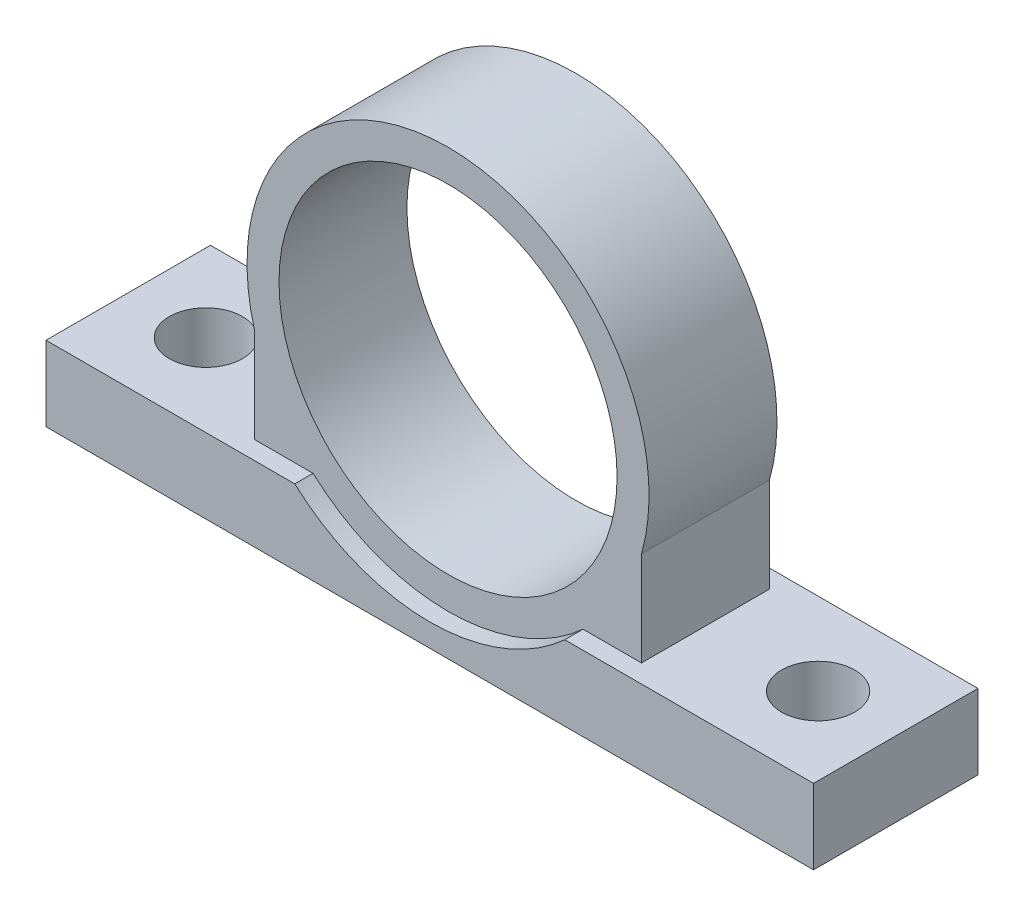
ISO-10303-21;
HEADER;
FILE_DESCRIPTION(('STEP AP214'),'2;1');
FILE_NAME('part.step','',(''),(''),'','','');
FILE_SCHEMA(('AUTOMOTIVE_DESIGN { 1 0 10303 214 1 1 1 1 }'));
ENDSEC;
DATA;
#1=APPLICATION_CONTEXT('core data for automotive mechanical design processes');
#2=APPLICATION_PROTOCOL_DEFINITION('international standard','automotive_design',2000,#1);
#3=PRODUCT_CONTEXT('',#1,'mechanical');
#4=PRODUCT('Part','Part','',(#3));
#5=PRODUCT_RELATED_PRODUCT_CATEGORY('part','',(#4));
#6=PRODUCT_DEFINITION_FORMATION('','',#4);
#7=PRODUCT_DEFINITION_CONTEXT('part definition',#1,'design');
#8=PRODUCT_DEFINITION('design','',#6,#7);
#9=PRODUCT_DEFINITION_SHAPE('','',#8);
#10=(LENGTH_UNIT() NAMED_UNIT(*) SI_UNIT(.MILLI.,.METRE.));
#11=(NAMED_UNIT(*) PLANE_ANGLE_UNIT() SI_UNIT($,.RADIAN.));
#12=(NAMED_UNIT(*) SI_UNIT($,.STERADIAN.) SOLID_ANGLE_UNIT());
#13=UNCERTAINTY_MEASURE_WITH_UNIT(LENGTH_MEASURE(1.E-05),#10,'distance_accuracy_value','');
#14=(GEOMETRIC_REPRESENTATION_CONTEXT(3) GLOBAL_UNCERTAINTY_ASSIGNED_CONTEXT((#13)) GLOBAL_UNIT_ASSIGNED_CONTEXT((#10,
#11,#12)) REPRESENTATION_CONTEXT('',''));
#15=CARTESIAN_POINT('',(0.,0.,0.));
#16=DIRECTION('',(0.,0.,1.));
#17=DIRECTION('',(1.,0.,0.));
#18=AXIS2_PLACEMENT_3D('',#15,#16,#17);
#19=CARTESIAN_POINT('',(-20.8246827445229,8.19999999999999,18.));
#20=DIRECTION('',(-1.,0.,0.));
#21=DIRECTION('',(0.,0.,1.));
#22=AXIS2_PLACEMENT_3D('',#19,#20,#21);
#23=PLANE('',#22);
#24=DIRECTION('',(0.,1.,0.));
#25=VECTOR('',#24,1.);
#26=CARTESIAN_POINT('',(-20.8246827445229,8.19999999999999,2.));
#27=LINE('',#26,#25);
#28=CARTESIAN_POINT('',(-20.8246827445229,8.19999999999999,2.));
#29=VERTEX_POINT('',#28);
#30=CARTESIAN_POINT('',(-20.8246827445229,18.5329287644697,2.));
#31=VERTEX_POINT('',#30);
#32=EDGE_CURVE('E151',#29,#31,#27,.T.);
#33=ORIENTED_EDGE('',*,*,#32,.T.);
#34=DIRECTION('',(0.,0.,-1.));
#35=VECTOR('',#34,1.);
#36=CARTESIAN_POINT('',(-20.8246827445229,18.5329287644697,18.));
#37=LINE('',#36,#35);
#38=CARTESIAN_POINT('',(-20.8246827445229,18.5329287644697,16.));
#39=VERTEX_POINT('',#38);
#40=EDGE_CURVE('E166',#39,#31,#37,.T.);
#41=ORIENTED_EDGE('',*,*,#40,.F.);
#42=DIRECTION('',(0.,1.,0.));
#43=VECTOR('',#42,1.);
#44=CARTESIAN_POINT('',(-20.8246827445229,8.19999999999999,16.));
#45=LINE('',#44,#43);
#46=CARTESIAN_POINT('',(-20.8246827445229,8.19999999999999,16.));
#47=VERTEX_POINT('',#46);
#48=EDGE_CURVE('E164',#47,#39,#45,.T.);
#49=ORIENTED_EDGE('',*,*,#48,.F.);
#50=DIRECTION('',(0.,0.,-1.));
#51=VECTOR('',#50,1.);
#52=CARTESIAN_POINT('',(-20.8246827445229,8.19999999999999,18.));
#53=LINE('',#52,#51);
#54=EDGE_CURVE('E49',#47,#29,#53,.T.);
#55=ORIENTED_EDGE('',*,*,#54,.T.);
#56=EDGE_LOOP('',(#33,#41,#49,#55));
#57=FACE_BOUND('',#56,.T.);
#58=ADVANCED_FACE('F39',(#57),#23,.F.);
#59=CARTESIAN_POINT('',(-42.,24.5,18.));
#60=DIRECTION('',(0.,0.,-1.));
#61=DIRECTION('',(-1.,0.,0.));
#62=AXIS2_PLACEMENT_3D('',#59,#60,#61);
#63=CYLINDRICAL_SURFACE('',#62,22.);
#64=CARTESIAN_POINT('',(-42.,24.5,2.));
#65=DIRECTION('',(0.,0.,1.));
#66=DIRECTION('',(1.,0.,0.));
#67=AXIS2_PLACEMENT_3D('',#64,#65,#66);
#68=CIRCLE('',#67,22.);
#69=CARTESIAN_POINT('',(-63.1753172554771,18.5329287644697,2.));
#70=VERTEX_POINT('',#69);
#71=EDGE_CURVE('E156',#31,#70,#68,.T.);
#72=ORIENTED_EDGE('',*,*,#71,.T.);
#73=DIRECTION('',(0.,0.,-1.));
#74=VECTOR('',#73,1.);
#75=CARTESIAN_POINT('',(-63.1753172554771,18.5329287644697,18.));
#76=LINE('',#75,#74);
#77=CARTESIAN_POINT('',(-63.1753172554771,18.5329287644697,16.));
#78=VERTEX_POINT('',#77);
#79=EDGE_CURVE('E169',#78,#70,#76,.T.);
#80=ORIENTED_EDGE('',*,*,#79,.F.);
#81=CARTESIAN_POINT('',(-42.,24.5,16.));
#82=DIRECTION('',(0.,0.,1.));
#83=DIRECTION('',(1.,0.,0.));
#84=AXIS2_PLACEMENT_3D('',#81,#82,#83);
#85=CIRCLE('',#84,22.);
#86=EDGE_CURVE('E241',#39,#78,#85,.T.);
#87=ORIENTED_EDGE('',*,*,#86,.F.);
#88=ORIENTED_EDGE('',*,*,#40,.T.);
#89=EDGE_LOOP('',(#72,#80,#87,#88));
#90=FACE_BOUND('',#89,.T.);
#91=ADVANCED_FACE('F316',(#90),#63,.T.);
#92=CARTESIAN_POINT('',(-63.1753172554771,8.19999999999999,18.));
#93=DIRECTION('',(1.,0.,0.));
#94=DIRECTION('',(0.,0.,-1.));
#95=AXIS2_PLACEMENT_3D('',#92,#93,#94);
#96=PLANE('',#95);
#97=DIRECTION('',(0.,-1.,0.));
#98=VECTOR('',#97,1.);
#99=CARTESIAN_POINT('',(-63.1753172554771,8.19999999999999,2.));
#100=LINE('',#99,#98);
#101=CARTESIAN_POINT('',(-63.1753172554771,8.19999999999999,2.));
#102=VERTEX_POINT('',#101);
#103=EDGE_CURVE('E261',#70,#102,#100,.T.);
#104=ORIENTED_EDGE('',*,*,#103,.T.);
#105=DIRECTION('',(0.,0.,-1.));
#106=VECTOR('',#105,1.);
#107=CARTESIAN_POINT('',(-63.1753172554771,8.19999999999999,18.));
#108=LINE('',#107,#106);
#109=CARTESIAN_POINT('',(-63.1753172554771,8.19999999999999,16.));
#110=VERTEX_POINT('',#109);
#111=EDGE_CURVE('E175',#110,#102,#108,.T.);
#112=ORIENTED_EDGE('',*,*,#111,.F.);
#113=DIRECTION('',(0.,-1.,0.));
#114=VECTOR('',#113,1.);
#115=CARTESIAN_POINT('',(-63.1753172554771,8.19999999999999,16.));
#116=LINE('',#115,#114);
#117=EDGE_CURVE('E56',#78,#110,#116,.T.);
#118=ORIENTED_EDGE('',*,*,#117,.F.);
#119=ORIENTED_EDGE('',*,*,#79,.T.);
#120=EDGE_LOOP('',(#104,#112,#118,#119));
#121=FACE_BOUND('',#120,.T.);
#122=ADVANCED_FACE('F320',(#121),#96,.F.);
#123=CARTESIAN_POINT('',(-42.,24.5,18.));
#124=DIRECTION('',(0.,0.,-1.));
#125=DIRECTION('',(-1.,0.,0.));
#126=AXIS2_PLACEMENT_3D('',#123,#124,#125);
#127=CYLINDRICAL_SURFACE('',#126,18.5);
#128=CARTESIAN_POINT('',(-42.,24.5,16.));
#129=DIRECTION('',(0.,0.,1.));
#130=DIRECTION('',(1.,0.,0.));
#131=AXIS2_PLACEMENT_3D('',#128,#129,#130);
#132=CIRCLE('',#131,18.5);
#133=CARTESIAN_POINT('',(-23.5,24.5,16.));
#134=VERTEX_POINT('',#133);
#135=EDGE_CURVE('E43',#134,#134,#132,.T.);
#136=ORIENTED_EDGE('',*,*,#135,.T.);
#137=EDGE_LOOP('',(#136));
#138=FACE_BOUND('',#137,.T.);
#139=CARTESIAN_POINT('',(-42.,24.5,2.00000000000001));
#140=DIRECTION('',(0.,0.,-1.));
#141=DIRECTION('',(-1.,0.,0.));
#142=AXIS2_PLACEMENT_3D('',#139,#140,#141);
#143=CIRCLE('',#142,18.5);
#144=CARTESIAN_POINT('',(-60.5,24.5,2.00000000000001));
#145=VERTEX_POINT('',#144);
#146=EDGE_CURVE('E229',#145,#145,#143,.T.);
#147=ORIENTED_EDGE('',*,*,#146,.T.);
#148=EDGE_LOOP('',(#147));
#149=FACE_BOUND('',#148,.T.);
#150=ADVANCED_FACE('F325',(#138,#149),#127,.F.);
#151=CARTESIAN_POINT('',(-42.,24.5,0.));
#152=DIRECTION('',(0.,0.,1.));
#153=DIRECTION('',(1.,0.,0.));
#154=AXIS2_PLACEMENT_3D('',#151,#152,#153);
#155=PLANE('',#154);
#156=DIRECTION('',(-1.,0.,0.));
#157=VECTOR('',#156,1.);
#158=CARTESIAN_POINT('',(-84.,8.19999999999999,0.));
#159=LINE('',#158,#157);
#160=CARTESIAN_POINT('',(-56.7753172554771,8.2,0.));
#161=VERTEX_POINT('',#160);
#162=CARTESIAN_POINT('',(-84.,8.19999999999999,0.));
#163=VERTEX_POINT('',#162);
#164=EDGE_CURVE('E195',#161,#163,#159,.T.);
#165=ORIENTED_EDGE('',*,*,#164,.F.);
#166=CARTESIAN_POINT('',(-42.,24.5,0.));
#167=DIRECTION('',(0.,0.,1.));
#168=DIRECTION('',(1.,0.,0.));
#169=AXIS2_PLACEMENT_3D('',#166,#167,#168);
#170=CIRCLE('',#169,22.);
#171=CARTESIAN_POINT('',(-27.2246827445229,8.19999999999999,0.));
#172=VERTEX_POINT('',#171);
#173=EDGE_CURVE('E161',#161,#172,#170,.T.);
#174=ORIENTED_EDGE('',*,*,#173,.T.);
#175=DIRECTION('',(-1.,0.,0.));
#176=VECTOR('',#175,1.);
#177=CARTESIAN_POINT('',(-20.8246827445229,8.19999999999999,0.));
#178=LINE('',#177,#176);
#179=CARTESIAN_POINT('',(0.,8.19999999999999,0.));
#180=VERTEX_POINT('',#179);
#181=EDGE_CURVE('E198',#180,#172,#178,.T.);
#182=ORIENTED_EDGE('',*,*,#181,.F.);
#183=DIRECTION('',(0.,1.,0.));
#184=VECTOR('',#183,1.);
#185=CARTESIAN_POINT('',(0.,8.19999999999999,0.));
#186=LINE('',#185,#184);
#187=CARTESIAN_POINT('',(0.,0.,0.));
#188=VERTEX_POINT('',#187);
#189=EDGE_CURVE('E201',#188,#180,#186,.T.);
#190=ORIENTED_EDGE('',*,*,#189,.F.);
#191=DIRECTION('',(1.,0.,0.));
#192=VECTOR('',#191,1.);
#193=CARTESIAN_POINT('',(0.,0.,0.));
#194=LINE('',#193,#192);
#195=CARTESIAN_POINT('',(-84.,0.,0.));
#196=VERTEX_POINT('',#195);
#197=EDGE_CURVE('E86',#196,#188,#194,.T.);
#198=ORIENTED_EDGE('',*,*,#197,.F.);
#199=DIRECTION('',(0.,-1.,0.));
#200=VECTOR('',#199,1.);
#201=CARTESIAN_POINT('',(-84.,0.,0.));
#202=LINE('',#201,#200);
#203=EDGE_CURVE('E192',#163,#196,#202,.T.);
#204=ORIENTED_EDGE('',*,*,#203,.F.);
#205=EDGE_LOOP('',(#165,#174,#182,#190,#198,#204));
#206=FACE_BOUND('',#205,.T.);
#207=ADVANCED_FACE('F331',(#206),#155,.F.);
#208=CARTESIAN_POINT('',(-42.,24.5,18.));
#209=DIRECTION('',(0.,0.,1.));
#210=DIRECTION('',(1.,0.,0.));
#211=AXIS2_PLACEMENT_3D('',#208,#209,#210);
#212=PLANE('',#211);
#213=DIRECTION('',(-1.,0.,0.));
#214=VECTOR('',#213,1.);
#215=CARTESIAN_POINT('',(-20.8246827445229,8.19999999999999,18.));
#216=LINE('',#215,#214);
#217=CARTESIAN_POINT('',(0.,8.19999999999999,18.));
#218=VERTEX_POINT('',#217);
#219=CARTESIAN_POINT('',(-27.2246827445229,8.19999999999999,18.));
#220=VERTEX_POINT('',#219);
#221=EDGE_CURVE('E93',#218,#220,#216,.T.);
#222=ORIENTED_EDGE('',*,*,#221,.T.);
#223=CARTESIAN_POINT('',(-42.,24.5,18.));
#224=DIRECTION('',(0.,0.,1.));
#225=DIRECTION('',(1.,0.,0.));
#226=AXIS2_PLACEMENT_3D('',#223,#224,#225);
#227=CIRCLE('',#226,22.);
#228=CARTESIAN_POINT('',(-56.7753172554771,8.2,18.));
#229=VERTEX_POINT('',#228);
#230=EDGE_CURVE('E225',#229,#220,#227,.T.);
#231=ORIENTED_EDGE('',*,*,#230,.F.);
#232=DIRECTION('',(-1.,0.,0.));
#233=VECTOR('',#232,1.);
#234=CARTESIAN_POINT('',(-84.,8.19999999999999,18.));
#235=LINE('',#234,#233);
#236=CARTESIAN_POINT('',(-84.,8.19999999999999,18.));
#237=VERTEX_POINT('',#236);
#238=EDGE_CURVE('E210',#229,#237,#235,.T.);
#239=ORIENTED_EDGE('',*,*,#238,.T.);
#240=DIRECTION('',(0.,-1.,0.));
#241=VECTOR('',#240,1.);
#242=CARTESIAN_POINT('',(-84.,0.,18.));
#243=LINE('',#242,#241);
#244=CARTESIAN_POINT('',(-84.,0.,18.));
#245=VERTEX_POINT('',#244);
#246=EDGE_CURVE('E207',#237,#245,#243,.T.);
#247=ORIENTED_EDGE('',*,*,#246,.T.);
#248=DIRECTION('',(1.,0.,0.));
#249=VECTOR('',#248,1.);
#250=CARTESIAN_POINT('',(0.,0.,18.));
#251=LINE('',#250,#249);
#252=CARTESIAN_POINT('',(0.,0.,18.));
#253=VERTEX_POINT('',#252);
#254=EDGE_CURVE('E65',#245,#253,#251,.T.);
#255=ORIENTED_EDGE('',*,*,#254,.T.);
#256=DIRECTION('',(0.,1.,0.));
#257=VECTOR('',#256,1.);
#258=CARTESIAN_POINT('',(0.,8.19999999999999,18.));
#259=LINE('',#258,#257);
#260=EDGE_CURVE('E191',#253,#218,#259,.T.);
#261=ORIENTED_EDGE('',*,*,#260,.T.);
#262=EDGE_LOOP('',(#222,#231,#239,#247,#255,#261));
#263=FACE_BOUND('',#262,.T.);
#264=ADVANCED_FACE('F312',(#263),#212,.T.);
#265=CARTESIAN_POINT('',(0.,8.19999999999999,18.));
#266=DIRECTION('',(-1.,0.,0.));
#267=DIRECTION('',(0.,0.,1.));
#268=AXIS2_PLACEMENT_3D('',#265,#266,#267);
#269=PLANE('',#268);
#270=ORIENTED_EDGE('',*,*,#189,.T.);
#271=DIRECTION('',(0.,0.,-1.));
#272=VECTOR('',#271,1.);
#273=CARTESIAN_POINT('',(0.,8.19999999999999,18.));
#274=LINE('',#273,#272);
#275=EDGE_CURVE('E11',#218,#180,#274,.T.);
#276=ORIENTED_EDGE('',*,*,#275,.F.);
#277=ORIENTED_EDGE('',*,*,#260,.F.);
#278=DIRECTION('',(0.,0.,-1.));
#279=VECTOR('',#278,1.);
#280=CARTESIAN_POINT('',(0.,0.,18.));
#281=LINE('',#280,#279);
#282=EDGE_CURVE('E186',#253,#188,#281,.T.);
#283=ORIENTED_EDGE('',*,*,#282,.T.);
#284=EDGE_LOOP('',(#270,#276,#277,#283));
#285=FACE_BOUND('',#284,.T.);
#286=ADVANCED_FACE('F41',(#285),#269,.F.);
#287=CARTESIAN_POINT('',(-20.8246827445229,8.19999999999999,18.));
#288=DIRECTION('',(0.,-1.,0.));
#289=DIRECTION('',(0.,0.,-1.));
#290=AXIS2_PLACEMENT_3D('',#287,#288,#289);
#291=PLANE('',#290);
#292=CARTESIAN_POINT('',(-8.5,8.19999999999999,9.));
#293=DIRECTION('',(0.,1.,0.));
#294=DIRECTION('',(0.,0.,1.));
#295=AXIS2_PLACEMENT_3D('',#292,#293,#294);
#296=CIRCLE('',#295,4.);
#297=CARTESIAN_POINT('',(-8.5,8.19999999999999,13.));
#298=VERTEX_POINT('',#297);
#299=EDGE_CURVE('E270',#298,#298,#296,.T.);
#300=ORIENTED_EDGE('',*,*,#299,.F.);
#301=EDGE_LOOP('',(#300));
#302=FACE_BOUND('',#301,.T.);
#303=ORIENTED_EDGE('',*,*,#181,.T.);
#304=DIRECTION('',(0.,0.,-1.));
#305=VECTOR('',#304,1.);
#306=CARTESIAN_POINT('',(-27.2246827445229,8.19999999999999,2.));
#307=LINE('',#306,#305);
#308=CARTESIAN_POINT('',(-27.2246827445229,8.19999999999999,2.));
#309=VERTEX_POINT('',#308);
#310=EDGE_CURVE('E146',#309,#172,#307,.T.);
#311=ORIENTED_EDGE('',*,*,#310,.F.);
#312=DIRECTION('',(1.,0.,0.));
#313=VECTOR('',#312,1.);
#314=CARTESIAN_POINT('',(-20.8246827445229,8.19999999999999,2.));
#315=LINE('',#314,#313);
#316=EDGE_CURVE('E140',#309,#29,#315,.T.);
#317=ORIENTED_EDGE('',*,*,#316,.T.);
#318=ORIENTED_EDGE('',*,*,#54,.F.);
#319=DIRECTION('',(1.,0.,0.));
#320=VECTOR('',#319,1.);
#321=CARTESIAN_POINT('',(-20.8246827445229,8.19999999999999,16.));
#322=LINE('',#321,#320);
#323=CARTESIAN_POINT('',(-27.2246827445229,8.19999999999999,16.));
#324=VERTEX_POINT('',#323);
#325=EDGE_CURVE('E222',#324,#47,#322,.T.);
#326=ORIENTED_EDGE('',*,*,#325,.F.);
#327=DIRECTION('',(0.,0.,1.));
#328=VECTOR('',#327,1.);
#329=CARTESIAN_POINT('',(-27.2246827445229,8.19999999999999,16.));
#330=LINE('',#329,#328);
#331=EDGE_CURVE('E221',#324,#220,#330,.T.);
#332=ORIENTED_EDGE('',*,*,#331,.T.);
#333=ORIENTED_EDGE('',*,*,#221,.F.);
#334=ORIENTED_EDGE('',*,*,#275,.T.);
#335=EDGE_LOOP('',(#303,#311,#317,#318,#326,#332,#333,#334));
#336=FACE_BOUND('',#335,.T.);
#337=ADVANCED_FACE('F142',(#302,#336),#291,.F.);
#338=CARTESIAN_POINT('',(-84.,8.19999999999999,18.));
#339=DIRECTION('',(0.,-1.,0.));
#340=DIRECTION('',(0.,0.,-1.));
#341=AXIS2_PLACEMENT_3D('',#338,#339,#340);
#342=PLANE('',#341);
#343=CARTESIAN_POINT('',(-75.5,8.19999999999999,9.));
#344=DIRECTION('',(0.,-1.,0.));
#345=DIRECTION('',(0.,0.,1.));
#346=AXIS2_PLACEMENT_3D('',#343,#344,#345);
#347=CIRCLE('',#346,4.);
#348=CARTESIAN_POINT('',(-75.5,8.19999999999999,13.));
#349=VERTEX_POINT('',#348);
#350=EDGE_CURVE('E278',#349,#349,#347,.T.);
#351=ORIENTED_EDGE('',*,*,#350,.T.);
#352=EDGE_LOOP('',(#351));
#353=FACE_BOUND('',#352,.T.);
#354=ORIENTED_EDGE('',*,*,#164,.T.);
#355=DIRECTION('',(0.,0.,-1.));
#356=VECTOR('',#355,1.);
#357=CARTESIAN_POINT('',(-84.,8.19999999999999,18.));
#358=LINE('',#357,#356);
#359=EDGE_CURVE('E179',#237,#163,#358,.T.);
#360=ORIENTED_EDGE('',*,*,#359,.F.);
#361=ORIENTED_EDGE('',*,*,#238,.F.);
#362=DIRECTION('',(0.,0.,1.));
#363=VECTOR('',#362,1.);
#364=CARTESIAN_POINT('',(-56.7753172554771,8.2,16.));
#365=LINE('',#364,#363);
#366=CARTESIAN_POINT('',(-56.7753172554771,8.2,16.));
#367=VERTEX_POINT('',#366);
#368=EDGE_CURVE('E217',#367,#229,#365,.T.);
#369=ORIENTED_EDGE('',*,*,#368,.F.);
#370=DIRECTION('',(1.,0.,0.));
#371=VECTOR('',#370,1.);
#372=CARTESIAN_POINT('',(-56.7753172554771,8.19999999999999,16.));
#373=LINE('',#372,#371);
#374=EDGE_CURVE('E236',#110,#367,#373,.T.);
#375=ORIENTED_EDGE('',*,*,#374,.F.);
#376=ORIENTED_EDGE('',*,*,#111,.T.);
#377=DIRECTION('',(1.,0.,0.));
#378=VECTOR('',#377,1.);
#379=CARTESIAN_POINT('',(-56.7753172554771,8.19999999999999,2.));
#380=LINE('',#379,#378);
#381=CARTESIAN_POINT('',(-56.7753172554771,8.2,2.));
#382=VERTEX_POINT('',#381);
#383=EDGE_CURVE('E265',#102,#382,#380,.T.);
#384=ORIENTED_EDGE('',*,*,#383,.T.);
#385=DIRECTION('',(0.,0.,-1.));
#386=VECTOR('',#385,1.);
#387=CARTESIAN_POINT('',(-56.7753172554771,8.2,2.));
#388=LINE('',#387,#386);
#389=EDGE_CURVE('E249',#382,#161,#388,.T.);
#390=ORIENTED_EDGE('',*,*,#389,.T.);
#391=EDGE_LOOP('',(#354,#360,#361,#369,#375,#376,#384,#390));
#392=FACE_BOUND('',#391,.T.);
#393=ADVANCED_FACE('F305',(#353,#392),#342,.F.);
#394=CARTESIAN_POINT('',(-84.,0.,18.));
#395=DIRECTION('',(1.,0.,0.));
#396=DIRECTION('',(0.,0.,-1.));
#397=AXIS2_PLACEMENT_3D('',#394,#395,#396);
#398=PLANE('',#397);
#399=ORIENTED_EDGE('',*,*,#203,.T.);
#400=DIRECTION('',(0.,0.,-1.));
#401=VECTOR('',#400,1.);
#402=CARTESIAN_POINT('',(-84.,0.,18.));
#403=LINE('',#402,#401);
#404=EDGE_CURVE('E183',#245,#196,#403,.T.);
#405=ORIENTED_EDGE('',*,*,#404,.F.);
#406=ORIENTED_EDGE('',*,*,#246,.F.);
#407=ORIENTED_EDGE('',*,*,#359,.T.);
#408=EDGE_LOOP('',(#399,#405,#406,#407));
#409=FACE_BOUND('',#408,.T.);
#410=ADVANCED_FACE('F293',(#409),#398,.F.);
#411=CARTESIAN_POINT('',(0.,0.,18.));
#412=DIRECTION('',(0.,1.,0.));
#413=DIRECTION('',(0.,0.,1.));
#414=AXIS2_PLACEMENT_3D('',#411,#412,#413);
#415=PLANE('',#414);
#416=CARTESIAN_POINT('',(-75.5,0.,9.));
#417=DIRECTION('',(0.,-1.,0.));
#418=DIRECTION('',(0.,0.,1.));
#419=AXIS2_PLACEMENT_3D('',#416,#417,#418);
#420=CIRCLE('',#419,4.);
#421=CARTESIAN_POINT('',(-75.5,0.,13.));
#422=VERTEX_POINT('',#421);
#423=EDGE_CURVE('E274',#422,#422,#420,.T.);
#424=ORIENTED_EDGE('',*,*,#423,.F.);
#425=EDGE_LOOP('',(#424));
#426=FACE_BOUND('',#425,.T.);
#427=CARTESIAN_POINT('',(-8.5,0.,9.));
#428=DIRECTION('',(0.,1.,0.));
#429=DIRECTION('',(0.,0.,1.));
#430=AXIS2_PLACEMENT_3D('',#427,#428,#429);
#431=CIRCLE('',#430,4.);
#432=CARTESIAN_POINT('',(-8.5,0.,13.));
#433=VERTEX_POINT('',#432);
#434=EDGE_CURVE('E258',#433,#433,#431,.T.);
#435=ORIENTED_EDGE('',*,*,#434,.T.);
#436=EDGE_LOOP('',(#435));
#437=FACE_BOUND('',#436,.T.);
#438=ORIENTED_EDGE('',*,*,#197,.T.);
#439=ORIENTED_EDGE('',*,*,#282,.F.);
#440=ORIENTED_EDGE('',*,*,#254,.F.);
#441=ORIENTED_EDGE('',*,*,#404,.T.);
#442=EDGE_LOOP('',(#438,#439,#440,#441));
#443=FACE_BOUND('',#442,.T.);
#444=ADVANCED_FACE('F289',(#426,#437,#443),#415,.F.);
#445=CARTESIAN_POINT('',(-42.,24.5,16.));
#446=DIRECTION('',(0.,0.,1.));
#447=DIRECTION('',(1.,0.,0.));
#448=AXIS2_PLACEMENT_3D('',#445,#446,#447);
#449=CYLINDRICAL_SURFACE('',#448,22.);
#450=ORIENTED_EDGE('',*,*,#230,.T.);
#451=ORIENTED_EDGE('',*,*,#331,.F.);
#452=CARTESIAN_POINT('',(-42.,24.5,16.));
#453=DIRECTION('',(0.,0.,1.));
#454=DIRECTION('',(1.,0.,0.));
#455=AXIS2_PLACEMENT_3D('',#452,#453,#454);
#456=CIRCLE('',#455,22.);
#457=EDGE_CURVE('E232',#367,#324,#456,.T.);
#458=ORIENTED_EDGE('',*,*,#457,.F.);
#459=ORIENTED_EDGE('',*,*,#368,.T.);
#460=EDGE_LOOP('',(#450,#451,#458,#459));
#461=FACE_BOUND('',#460,.T.);
#462=ADVANCED_FACE('F292',(#461),#449,.F.);
#463=CARTESIAN_POINT('',(-42.,24.5,16.));
#464=DIRECTION('',(0.,0.,1.));
#465=DIRECTION('',(1.,0.,0.));
#466=AXIS2_PLACEMENT_3D('',#463,#464,#465);
#467=PLANE('',#466);
#468=ORIENTED_EDGE('',*,*,#135,.F.);
#469=EDGE_LOOP('',(#468));
#470=FACE_BOUND('',#469,.T.);
#471=ORIENTED_EDGE('',*,*,#48,.T.);
#472=ORIENTED_EDGE('',*,*,#86,.T.);
#473=ORIENTED_EDGE('',*,*,#117,.T.);
#474=ORIENTED_EDGE('',*,*,#374,.T.);
#475=ORIENTED_EDGE('',*,*,#457,.T.);
#476=ORIENTED_EDGE('',*,*,#325,.T.);
#477=EDGE_LOOP('',(#471,#472,#473,#474,#475,#476));
#478=FACE_BOUND('',#477,.T.);
#479=ADVANCED_FACE('F342',(#470,#478),#467,.T.);
#480=CARTESIAN_POINT('',(-42.,24.5,2.));
#481=DIRECTION('',(0.,0.,-1.));
#482=DIRECTION('',(1.,0.,0.));
#483=AXIS2_PLACEMENT_3D('',#480,#481,#482);
#484=PLANE('',#483);
#485=ORIENTED_EDGE('',*,*,#146,.F.);
#486=EDGE_LOOP('',(#485));
#487=FACE_BOUND('',#486,.T.);
#488=ORIENTED_EDGE('',*,*,#32,.F.);
#489=ORIENTED_EDGE('',*,*,#316,.F.);
#490=CARTESIAN_POINT('',(-42.,24.5,2.));
#491=DIRECTION('',(0.,0.,1.));
#492=DIRECTION('',(1.,0.,0.));
#493=AXIS2_PLACEMENT_3D('',#490,#491,#492);
#494=CIRCLE('',#493,22.);
#495=EDGE_CURVE('E150',#382,#309,#494,.T.);
#496=ORIENTED_EDGE('',*,*,#495,.F.);
#497=ORIENTED_EDGE('',*,*,#383,.F.);
#498=ORIENTED_EDGE('',*,*,#103,.F.);
#499=ORIENTED_EDGE('',*,*,#71,.F.);
#500=EDGE_LOOP('',(#488,#489,#496,#497,#498,#499));
#501=FACE_BOUND('',#500,.T.);
#502=ADVANCED_FACE('F154',(#487,#501),#484,.T.);
#503=CARTESIAN_POINT('',(-42.,24.5,2.));
#504=DIRECTION('',(0.,0.,-1.));
#505=DIRECTION('',(-1.,0.,0.));
#506=AXIS2_PLACEMENT_3D('',#503,#504,#505);
#507=CYLINDRICAL_SURFACE('',#506,22.);
#508=ORIENTED_EDGE('',*,*,#173,.F.);
#509=ORIENTED_EDGE('',*,*,#389,.F.);
#510=ORIENTED_EDGE('',*,*,#495,.T.);
#511=ORIENTED_EDGE('',*,*,#310,.T.);
#512=EDGE_LOOP('',(#508,#509,#510,#511));
#513=FACE_BOUND('',#512,.T.);
#514=ADVANCED_FACE('F300',(#513),#507,.F.);
#515=CARTESIAN_POINT('',(-8.5,0.,9.));
#516=DIRECTION('',(0.,1.,0.));
#517=DIRECTION('',(0.,0.,1.));
#518=AXIS2_PLACEMENT_3D('',#515,#516,#517);
#519=CYLINDRICAL_SURFACE('',#518,4.);
#520=ORIENTED_EDGE('',*,*,#434,.F.);
#521=EDGE_LOOP('',(#520));
#522=FACE_BOUND('',#521,.T.);
#523=ORIENTED_EDGE('',*,*,#299,.T.);
#524=EDGE_LOOP('',(#523));
#525=FACE_BOUND('',#524,.T.);
#526=ADVANCED_FACE('F297',(#522,#525),#519,.F.);
#527=CARTESIAN_POINT('',(-75.5,0.,9.));
#528=DIRECTION('',(0.,1.,0.));
#529=DIRECTION('',(0.,0.,1.));
#530=AXIS2_PLACEMENT_3D('',#527,#528,#529);
#531=CYLINDRICAL_SURFACE('',#530,4.);
#532=ORIENTED_EDGE('',*,*,#423,.T.);
#533=EDGE_LOOP('',(#532));
#534=FACE_BOUND('',#533,.T.);
#535=ORIENTED_EDGE('',*,*,#350,.F.);
#536=EDGE_LOOP('',(#535));
#537=FACE_BOUND('',#536,.T.);
#538=ADVANCED_FACE('F286',(#534,#537),#531,.F.);
#539=CLOSED_SHELL('',(#58,#91,#122,#150,#207,#264,#286,#337,#393,#410,#444,#462,#479,#502,#514,
#526,#538));
#540=MANIFOLD_SOLID_BREP('B2',#539);
#541=ADVANCED_BREP_SHAPE_REPRESENTATION('',(#18,#540),#14);
#542=SHAPE_DEFINITION_REPRESENTATION(#9,#541);
ENDSEC;
END-ISO-10303-21;
